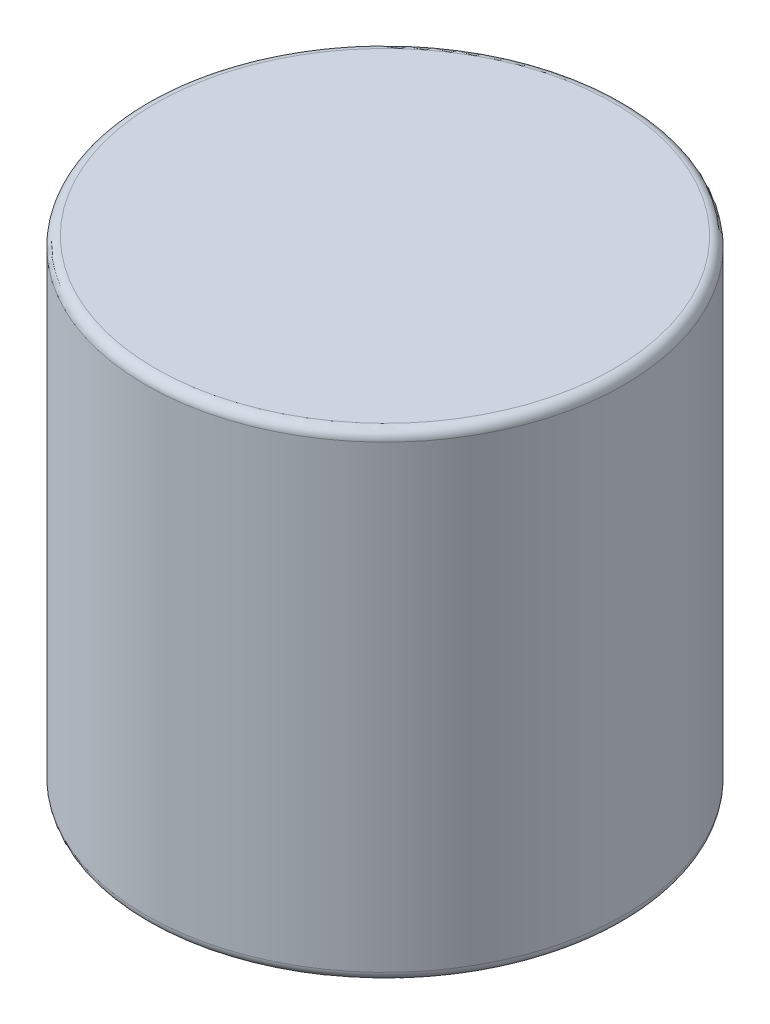
ISO-10303-21;
HEADER;
FILE_DESCRIPTION(('STEP AP214'),'2;1');
FILE_NAME('part.step','',(''),(''),'','','');
FILE_SCHEMA(('AUTOMOTIVE_DESIGN { 1 0 10303 214 1 1 1 1 }'));
ENDSEC;
DATA;
#1=APPLICATION_CONTEXT('core data for automotive mechanical design processes');
#2=APPLICATION_PROTOCOL_DEFINITION('international standard','automotive_design',2000,#1);
#3=PRODUCT_CONTEXT('',#1,'mechanical');
#4=PRODUCT('Part','Part','',(#3));
#5=PRODUCT_RELATED_PRODUCT_CATEGORY('part','',(#4));
#6=PRODUCT_DEFINITION_FORMATION('','',#4);
#7=PRODUCT_DEFINITION_CONTEXT('part definition',#1,'design');
#8=PRODUCT_DEFINITION('design','',#6,#7);
#9=PRODUCT_DEFINITION_SHAPE('','',#8);
#10=(LENGTH_UNIT() NAMED_UNIT(*) SI_UNIT(.MILLI.,.METRE.));
#11=(NAMED_UNIT(*) PLANE_ANGLE_UNIT() SI_UNIT($,.RADIAN.));
#12=(NAMED_UNIT(*) SI_UNIT($,.STERADIAN.) SOLID_ANGLE_UNIT());
#13=UNCERTAINTY_MEASURE_WITH_UNIT(LENGTH_MEASURE(1.E-05),#10,'distance_accuracy_value','');
#14=(GEOMETRIC_REPRESENTATION_CONTEXT(3) GLOBAL_UNCERTAINTY_ASSIGNED_CONTEXT((#13)) GLOBAL_UNIT_ASSIGNED_CONTEXT((#10,
#11,#12)) REPRESENTATION_CONTEXT('',''));
#15=CARTESIAN_POINT('',(0.,0.,0.));
#16=DIRECTION('',(0.,0.,1.));
#17=DIRECTION('',(1.,0.,0.));
#18=AXIS2_PLACEMENT_3D('',#15,#16,#17);
#19=CARTESIAN_POINT('',(0.,10.,0.));
#20=DIRECTION('',(0.,-1.,0.));
#21=DIRECTION('',(0.,0.,-1.));
#22=AXIS2_PLACEMENT_3D('',#19,#20,#21);
#23=CYLINDRICAL_SURFACE('',#22,5.);
#24=CARTESIAN_POINT('',(0.,0.200000000000001,0.));
#25=DIRECTION('',(0.,1.,0.));
#26=DIRECTION('',(0.,0.,1.));
#27=AXIS2_PLACEMENT_3D('',#24,#25,#26);
#28=CIRCLE('',#27,5.);
#29=CARTESIAN_POINT('',(0.,0.200000000000001,5.));
#30=VERTEX_POINT('',#29);
#31=EDGE_CURVE('E47',#30,#30,#28,.T.);
#32=ORIENTED_EDGE('',*,*,#31,.T.);
#33=EDGE_LOOP('',(#32));
#34=FACE_BOUND('',#33,.T.);
#35=CARTESIAN_POINT('',(0.,9.8,0.));
#36=DIRECTION('',(0.,1.,0.));
#37=DIRECTION('',(0.,0.,1.));
#38=AXIS2_PLACEMENT_3D('',#35,#36,#37);
#39=CIRCLE('',#38,5.);
#40=CARTESIAN_POINT('',(0.,9.8,5.));
#41=VERTEX_POINT('',#40);
#42=EDGE_CURVE('E51',#41,#41,#39,.F.);
#43=ORIENTED_EDGE('',*,*,#42,.T.);
#44=EDGE_LOOP('',(#43));
#45=FACE_BOUND('',#44,.T.);
#46=ADVANCED_FACE('F36',(#34,#45),#23,.T.);
#47=CARTESIAN_POINT('',(0.,10.,0.));
#48=DIRECTION('',(0.,1.,0.));
#49=DIRECTION('',(0.,0.,1.));
#50=AXIS2_PLACEMENT_3D('',#47,#48,#49);
#51=PLANE('',#50);
#52=CARTESIAN_POINT('',(0.,10.,0.));
#53=DIRECTION('',(0.,1.,0.));
#54=DIRECTION('',(0.,0.,1.));
#55=AXIS2_PLACEMENT_3D('',#52,#53,#54);
#56=CIRCLE('',#55,4.8);
#57=CARTESIAN_POINT('',(0.,10.,4.8));
#58=VERTEX_POINT('',#57);
#59=EDGE_CURVE('E10',#58,#58,#56,.T.);
#60=ORIENTED_EDGE('',*,*,#59,.T.);
#61=EDGE_LOOP('',(#60));
#62=FACE_BOUND('',#61,.T.);
#63=ADVANCED_FACE('F67',(#62),#51,.T.);
#64=CARTESIAN_POINT('',(0.,0.,0.));
#65=DIRECTION('',(0.,1.,0.));
#66=DIRECTION('',(0.,0.,1.));
#67=AXIS2_PLACEMENT_3D('',#64,#65,#66);
#68=PLANE('',#67);
#69=CARTESIAN_POINT('',(0.,0.,0.));
#70=DIRECTION('',(0.,1.,0.));
#71=DIRECTION('',(0.,0.,1.));
#72=AXIS2_PLACEMENT_3D('',#69,#70,#71);
#73=CIRCLE('',#72,4.8);
#74=CARTESIAN_POINT('',(0.,0.,4.8));
#75=VERTEX_POINT('',#74);
#76=EDGE_CURVE('E43',#75,#75,#73,.F.);
#77=ORIENTED_EDGE('',*,*,#76,.T.);
#78=EDGE_LOOP('',(#77));
#79=FACE_BOUND('',#78,.T.);
#80=ADVANCED_FACE('F64',(#79),#68,.F.);
#81=CARTESIAN_POINT('',(0.,0.200000000000001,0.));
#82=DIRECTION('',(0.,1.,0.));
#83=DIRECTION('',(0.,0.,1.));
#84=AXIS2_PLACEMENT_3D('',#81,#82,#83);
#85=TOROIDAL_SURFACE('',#84,4.8,0.2);
#86=ORIENTED_EDGE('',*,*,#76,.F.);
#87=EDGE_LOOP('',(#86));
#88=FACE_BOUND('',#87,.T.);
#89=ORIENTED_EDGE('',*,*,#31,.F.);
#90=EDGE_LOOP('',(#89));
#91=FACE_BOUND('',#90,.T.);
#92=ADVANCED_FACE('F60',(#88,#91),#85,.T.);
#93=CARTESIAN_POINT('',(0.,9.8,0.));
#94=DIRECTION('',(0.,1.,0.));
#95=DIRECTION('',(0.,0.,1.));
#96=AXIS2_PLACEMENT_3D('',#93,#94,#95);
#97=TOROIDAL_SURFACE('',#96,4.8,0.2);
#98=ORIENTED_EDGE('',*,*,#42,.F.);
#99=EDGE_LOOP('',(#98));
#100=FACE_BOUND('',#99,.T.);
#101=ORIENTED_EDGE('',*,*,#59,.F.);
#102=EDGE_LOOP('',(#101));
#103=FACE_BOUND('',#102,.T.);
#104=ADVANCED_FACE('F38',(#100,#103),#97,.T.);
#105=CLOSED_SHELL('',(#46,#63,#80,#92,#104));
#106=MANIFOLD_SOLID_BREP('B2',#105);
#107=ADVANCED_BREP_SHAPE_REPRESENTATION('',(#18,#106),#14);
#108=SHAPE_DEFINITION_REPRESENTATION(#9,#107);
ENDSEC;
END-ISO-10303-21;
